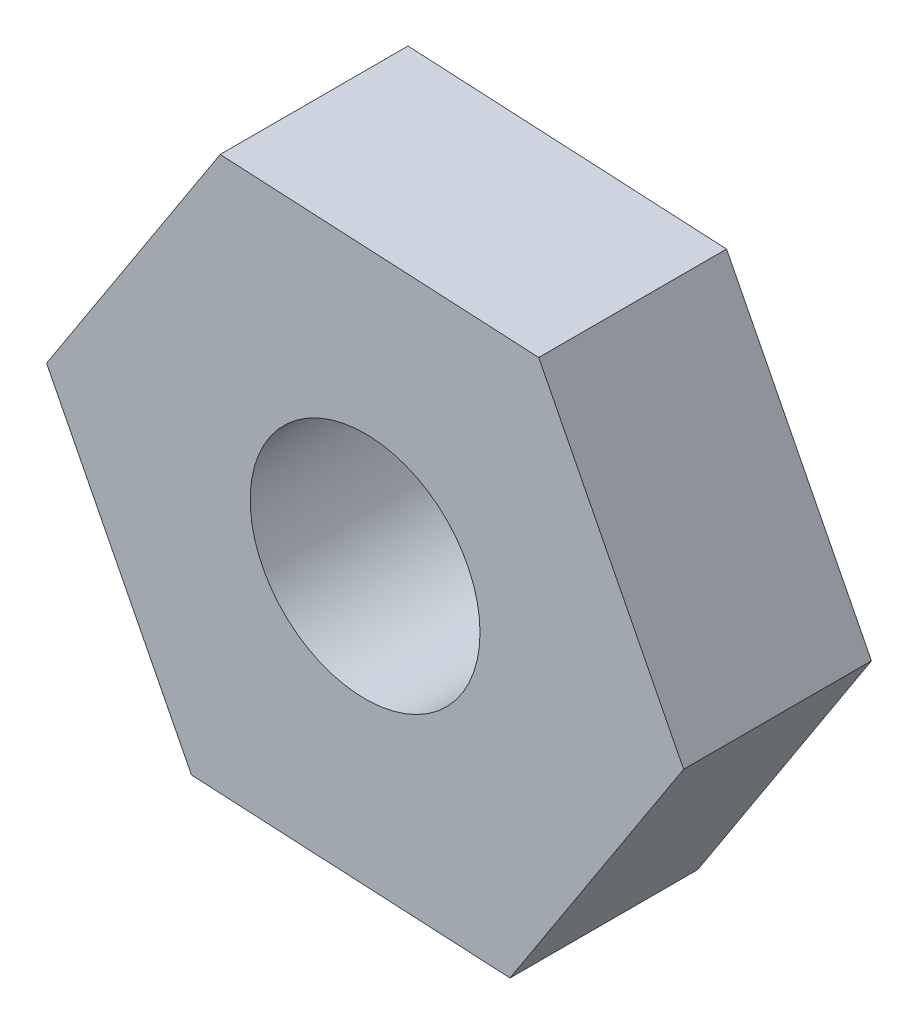
ISO-10303-21;
HEADER;
FILE_DESCRIPTION(('STEP AP214'),'2;1');
FILE_NAME('part.step','',(''),(''),'','','');
FILE_SCHEMA(('AUTOMOTIVE_DESIGN { 1 0 10303 214 1 1 1 1 }'));
ENDSEC;
DATA;
#1=APPLICATION_CONTEXT('core data for automotive mechanical design processes');
#2=APPLICATION_PROTOCOL_DEFINITION('international standard','automotive_design',2000,#1);
#3=PRODUCT_CONTEXT('',#1,'mechanical');
#4=PRODUCT('Part','Part','',(#3));
#5=PRODUCT_RELATED_PRODUCT_CATEGORY('part','',(#4));
#6=PRODUCT_DEFINITION_FORMATION('','',#4);
#7=PRODUCT_DEFINITION_CONTEXT('part definition',#1,'design');
#8=PRODUCT_DEFINITION('design','',#6,#7);
#9=PRODUCT_DEFINITION_SHAPE('','',#8);
#10=(LENGTH_UNIT() NAMED_UNIT(*) SI_UNIT(.MILLI.,.METRE.));
#11=(NAMED_UNIT(*) PLANE_ANGLE_UNIT() SI_UNIT($,.RADIAN.));
#12=(NAMED_UNIT(*) SI_UNIT($,.STERADIAN.) SOLID_ANGLE_UNIT());
#13=UNCERTAINTY_MEASURE_WITH_UNIT(LENGTH_MEASURE(1.E-05),#10,'distance_accuracy_value','');
#14=(GEOMETRIC_REPRESENTATION_CONTEXT(3) GLOBAL_UNCERTAINTY_ASSIGNED_CONTEXT((#13)) GLOBAL_UNIT_ASSIGNED_CONTEXT((#10,
#11,#12)) REPRESENTATION_CONTEXT('',''));
#15=CARTESIAN_POINT('',(0.,0.,0.));
#16=DIRECTION('',(0.,0.,1.));
#17=DIRECTION('',(1.,0.,0.));
#18=AXIS2_PLACEMENT_3D('',#15,#16,#17);
#19=CARTESIAN_POINT('',(0.,0.,7.));
#20=DIRECTION('',(0.,0.,1.));
#21=DIRECTION('',(1.,0.,0.));
#22=AXIS2_PLACEMENT_3D('',#19,#20,#21);
#23=PLANE('',#22);
#24=DIRECTION('',(0.998647533945761,-0.0519913737465246,0.));
#25=VECTOR('',#24,1.);
#26=CARTESIAN_POINT('',(-6.47165974450722,-9.97301415999718,7.));
#27=LINE('',#26,#25);
#28=CARTESIAN_POINT('',(-6.47165974450722,-9.97301415999718,7.));
#29=VERTEX_POINT('',#28);
#30=CARTESIAN_POINT('',(5.40105374260587,-10.591128823391,7.));
#31=VERTEX_POINT('',#30);
#32=EDGE_CURVE('E146',#29,#31,#27,.T.);
#33=ORIENTED_EDGE('',*,*,#32,.T.);
#34=DIRECTION('',(0.544349617415022,0.838858446950449,0.));
#35=VECTOR('',#34,1.);
#36=CARTESIAN_POINT('',(5.40105374260587,-10.591128823391,7.));
#37=LINE('',#36,#35);
#38=CARTESIAN_POINT('',(11.8727134871131,-0.618114663393764,7.));
#39=VERTEX_POINT('',#38);
#40=EDGE_CURVE('E94',#31,#39,#37,.T.);
#41=ORIENTED_EDGE('',*,*,#40,.T.);
#42=DIRECTION('',(-0.454297916530739,0.890849820696974,0.));
#43=VECTOR('',#42,1.);
#44=CARTESIAN_POINT('',(11.8727134871131,-0.618114663393764,7.));
#45=LINE('',#44,#43);
#46=CARTESIAN_POINT('',(6.47165974450721,9.97301415999718,7.));
#47=VERTEX_POINT('',#46);
#48=EDGE_CURVE('E107',#39,#47,#45,.T.);
#49=ORIENTED_EDGE('',*,*,#48,.T.);
#50=DIRECTION('',(-0.998647533945761,0.0519913737465245,0.));
#51=VECTOR('',#50,1.);
#52=CARTESIAN_POINT('',(6.47165974450721,9.97301415999718,7.));
#53=LINE('',#52,#51);
#54=CARTESIAN_POINT('',(-5.40105374260588,10.591128823391,7.));
#55=VERTEX_POINT('',#54);
#56=EDGE_CURVE('E101',#47,#55,#53,.T.);
#57=ORIENTED_EDGE('',*,*,#56,.T.);
#58=DIRECTION('',(-0.544349617415022,-0.838858446950449,0.));
#59=VECTOR('',#58,1.);
#60=CARTESIAN_POINT('',(-5.40105374260588,10.591128823391,7.));
#61=LINE('',#60,#59);
#62=CARTESIAN_POINT('',(-11.8727134871131,0.618114663393768,7.));
#63=VERTEX_POINT('',#62);
#64=EDGE_CURVE('E105',#55,#63,#61,.T.);
#65=ORIENTED_EDGE('',*,*,#64,.T.);
#66=DIRECTION('',(0.454297916530739,-0.890849820696974,0.));
#67=VECTOR('',#66,1.);
#68=CARTESIAN_POINT('',(-11.8727134871131,0.618114663393768,7.));
#69=LINE('',#68,#67);
#70=EDGE_CURVE('E57',#63,#29,#69,.T.);
#71=ORIENTED_EDGE('',*,*,#70,.T.);
#72=EDGE_LOOP('',(#33,#41,#49,#57,#65,#71));
#73=FACE_BOUND('',#72,.T.);
#74=CARTESIAN_POINT('',(0.,0.,7.));
#75=DIRECTION('',(0.,0.,1.));
#76=DIRECTION('',(1.,0.,0.));
#77=AXIS2_PLACEMENT_3D('',#74,#75,#76);
#78=CIRCLE('',#77,4.28343841388034);
#79=CARTESIAN_POINT('',(4.28343841388034,0.,7.));
#80=VERTEX_POINT('',#79);
#81=EDGE_CURVE('E134',#80,#80,#78,.T.);
#82=ORIENTED_EDGE('',*,*,#81,.F.);
#83=EDGE_LOOP('',(#82));
#84=FACE_BOUND('',#83,.T.);
#85=ADVANCED_FACE('F39',(#73,#84),#23,.T.);
#86=CARTESIAN_POINT('',(0.,0.,0.));
#87=DIRECTION('',(0.,0.,1.));
#88=DIRECTION('',(1.,0.,0.));
#89=AXIS2_PLACEMENT_3D('',#86,#87,#88);
#90=PLANE('',#89);
#91=DIRECTION('',(0.998647533945761,-0.0519913737465246,0.));
#92=VECTOR('',#91,1.);
#93=CARTESIAN_POINT('',(-6.47165974450722,-9.97301415999718,0.));
#94=LINE('',#93,#92);
#95=CARTESIAN_POINT('',(-6.47165974450722,-9.97301415999718,0.));
#96=VERTEX_POINT('',#95);
#97=CARTESIAN_POINT('',(5.40105374260587,-10.591128823391,0.));
#98=VERTEX_POINT('',#97);
#99=EDGE_CURVE('E129',#96,#98,#94,.T.);
#100=ORIENTED_EDGE('',*,*,#99,.F.);
#101=DIRECTION('',(0.454297916530739,-0.890849820696974,0.));
#102=VECTOR('',#101,1.);
#103=CARTESIAN_POINT('',(-11.8727134871131,0.618114663393768,0.));
#104=LINE('',#103,#102);
#105=CARTESIAN_POINT('',(-11.8727134871131,0.618114663393768,0.));
#106=VERTEX_POINT('',#105);
#107=EDGE_CURVE('E86',#106,#96,#104,.T.);
#108=ORIENTED_EDGE('',*,*,#107,.F.);
#109=DIRECTION('',(-0.544349617415022,-0.838858446950449,0.));
#110=VECTOR('',#109,1.);
#111=CARTESIAN_POINT('',(-5.40105374260588,10.591128823391,0.));
#112=LINE('',#111,#110);
#113=CARTESIAN_POINT('',(-5.40105374260588,10.591128823391,0.));
#114=VERTEX_POINT('',#113);
#115=EDGE_CURVE('E80',#114,#106,#112,.T.);
#116=ORIENTED_EDGE('',*,*,#115,.F.);
#117=DIRECTION('',(-0.998647533945761,0.0519913737465245,0.));
#118=VECTOR('',#117,1.);
#119=CARTESIAN_POINT('',(6.47165974450721,9.97301415999718,0.));
#120=LINE('',#119,#118);
#121=CARTESIAN_POINT('',(6.47165974450721,9.97301415999718,0.));
#122=VERTEX_POINT('',#121);
#123=EDGE_CURVE('E116',#122,#114,#120,.T.);
#124=ORIENTED_EDGE('',*,*,#123,.F.);
#125=DIRECTION('',(-0.454297916530739,0.890849820696974,0.));
#126=VECTOR('',#125,1.);
#127=CARTESIAN_POINT('',(11.8727134871131,-0.618114663393764,0.));
#128=LINE('',#127,#126);
#129=CARTESIAN_POINT('',(11.8727134871131,-0.618114663393764,0.));
#130=VERTEX_POINT('',#129);
#131=EDGE_CURVE('E137',#130,#122,#128,.T.);
#132=ORIENTED_EDGE('',*,*,#131,.F.);
#133=DIRECTION('',(0.544349617415022,0.838858446950449,0.));
#134=VECTOR('',#133,1.);
#135=CARTESIAN_POINT('',(5.40105374260587,-10.591128823391,0.));
#136=LINE('',#135,#134);
#137=EDGE_CURVE('E133',#98,#130,#136,.T.);
#138=ORIENTED_EDGE('',*,*,#137,.F.);
#139=EDGE_LOOP('',(#100,#108,#116,#124,#132,#138));
#140=FACE_BOUND('',#139,.T.);
#141=CARTESIAN_POINT('',(0.,0.,0.));
#142=DIRECTION('',(0.,0.,1.));
#143=DIRECTION('',(1.,0.,0.));
#144=AXIS2_PLACEMENT_3D('',#141,#142,#143);
#145=CIRCLE('',#144,4.28343841388034);
#146=CARTESIAN_POINT('',(4.28343841388034,0.,0.));
#147=VERTEX_POINT('',#146);
#148=EDGE_CURVE('E243',#147,#147,#145,.T.);
#149=ORIENTED_EDGE('',*,*,#148,.T.);
#150=EDGE_LOOP('',(#149));
#151=FACE_BOUND('',#150,.T.);
#152=ADVANCED_FACE('F159',(#140,#151),#90,.F.);
#153=CARTESIAN_POINT('',(-6.47165974450722,-9.97301415999718,7.));
#154=DIRECTION('',(0.0519913737465247,0.998647533945761,0.));
#155=DIRECTION('',(-0.998647533945761,0.0519913737465247,0.));
#156=AXIS2_PLACEMENT_3D('',#153,#154,#155);
#157=PLANE('',#156);
#158=ORIENTED_EDGE('',*,*,#99,.T.);
#159=DIRECTION('',(0.,0.,-1.));
#160=VECTOR('',#159,1.);
#161=CARTESIAN_POINT('',(5.40105374260587,-10.591128823391,7.));
#162=LINE('',#161,#160);
#163=EDGE_CURVE('E11',#31,#98,#162,.T.);
#164=ORIENTED_EDGE('',*,*,#163,.F.);
#165=ORIENTED_EDGE('',*,*,#32,.F.);
#166=DIRECTION('',(0.,0.,-1.));
#167=VECTOR('',#166,1.);
#168=CARTESIAN_POINT('',(-6.47165974450722,-9.97301415999718,7.));
#169=LINE('',#168,#167);
#170=EDGE_CURVE('E125',#29,#96,#169,.T.);
#171=ORIENTED_EDGE('',*,*,#170,.T.);
#172=EDGE_LOOP('',(#158,#164,#165,#171));
#173=FACE_BOUND('',#172,.T.);
#174=ADVANCED_FACE('F41',(#173),#157,.F.);
#175=CARTESIAN_POINT('',(5.40105374260587,-10.591128823391,7.));
#176=DIRECTION('',(-0.838858446950449,0.544349617415022,0.));
#177=DIRECTION('',(-0.544349617415022,-0.838858446950449,0.));
#178=AXIS2_PLACEMENT_3D('',#175,#176,#177);
#179=PLANE('',#178);
#180=ORIENTED_EDGE('',*,*,#137,.T.);
#181=DIRECTION('',(0.,0.,-1.));
#182=VECTOR('',#181,1.);
#183=CARTESIAN_POINT('',(11.8727134871131,-0.618114663393764,7.));
#184=LINE('',#183,#182);
#185=EDGE_CURVE('E49',#39,#130,#184,.T.);
#186=ORIENTED_EDGE('',*,*,#185,.F.);
#187=ORIENTED_EDGE('',*,*,#40,.F.);
#188=ORIENTED_EDGE('',*,*,#163,.T.);
#189=EDGE_LOOP('',(#180,#186,#187,#188));
#190=FACE_BOUND('',#189,.T.);
#191=ADVANCED_FACE('F184',(#190),#179,.F.);
#192=CARTESIAN_POINT('',(11.8727134871131,-0.618114663393764,7.));
#193=DIRECTION('',(-0.890849820696973,-0.454297916530739,0.));
#194=DIRECTION('',(0.454297916530739,-0.890849820696974,0.));
#195=AXIS2_PLACEMENT_3D('',#192,#193,#194);
#196=PLANE('',#195);
#197=ORIENTED_EDGE('',*,*,#131,.T.);
#198=DIRECTION('',(0.,0.,-1.));
#199=VECTOR('',#198,1.);
#200=CARTESIAN_POINT('',(6.47165974450721,9.97301415999718,7.));
#201=LINE('',#200,#199);
#202=EDGE_CURVE('E118',#47,#122,#201,.T.);
#203=ORIENTED_EDGE('',*,*,#202,.F.);
#204=ORIENTED_EDGE('',*,*,#48,.F.);
#205=ORIENTED_EDGE('',*,*,#185,.T.);
#206=EDGE_LOOP('',(#197,#203,#204,#205));
#207=FACE_BOUND('',#206,.T.);
#208=ADVANCED_FACE('F156',(#207),#196,.F.);
#209=CARTESIAN_POINT('',(6.47165974450721,9.97301415999718,7.));
#210=DIRECTION('',(-0.0519913737465245,-0.998647533945761,0.));
#211=DIRECTION('',(0.998647533945761,-0.0519913737465245,0.));
#212=AXIS2_PLACEMENT_3D('',#209,#210,#211);
#213=PLANE('',#212);
#214=ORIENTED_EDGE('',*,*,#123,.T.);
#215=DIRECTION('',(0.,0.,-1.));
#216=VECTOR('',#215,1.);
#217=CARTESIAN_POINT('',(-5.40105374260588,10.591128823391,7.));
#218=LINE('',#217,#216);
#219=EDGE_CURVE('E113',#55,#114,#218,.T.);
#220=ORIENTED_EDGE('',*,*,#219,.F.);
#221=ORIENTED_EDGE('',*,*,#56,.F.);
#222=ORIENTED_EDGE('',*,*,#202,.T.);
#223=EDGE_LOOP('',(#214,#220,#221,#222));
#224=FACE_BOUND('',#223,.T.);
#225=ADVANCED_FACE('F114',(#224),#213,.F.);
#226=CARTESIAN_POINT('',(-5.40105374260588,10.591128823391,7.));
#227=DIRECTION('',(0.838858446950449,-0.544349617415022,0.));
#228=DIRECTION('',(0.544349617415022,0.838858446950449,0.));
#229=AXIS2_PLACEMENT_3D('',#226,#227,#228);
#230=PLANE('',#229);
#231=ORIENTED_EDGE('',*,*,#115,.T.);
#232=DIRECTION('',(0.,0.,-1.));
#233=VECTOR('',#232,1.);
#234=CARTESIAN_POINT('',(-11.8727134871131,0.618114663393768,7.));
#235=LINE('',#234,#233);
#236=EDGE_CURVE('E119',#63,#106,#235,.T.);
#237=ORIENTED_EDGE('',*,*,#236,.F.);
#238=ORIENTED_EDGE('',*,*,#64,.F.);
#239=ORIENTED_EDGE('',*,*,#219,.T.);
#240=EDGE_LOOP('',(#231,#237,#238,#239));
#241=FACE_BOUND('',#240,.T.);
#242=ADVANCED_FACE('F121',(#241),#230,.F.);
#243=CARTESIAN_POINT('',(-11.8727134871131,0.618114663393768,7.));
#244=DIRECTION('',(0.890849820696973,0.454297916530739,0.));
#245=DIRECTION('',(-0.454297916530739,0.890849820696974,0.));
#246=AXIS2_PLACEMENT_3D('',#243,#244,#245);
#247=PLANE('',#246);
#248=ORIENTED_EDGE('',*,*,#107,.T.);
#249=ORIENTED_EDGE('',*,*,#170,.F.);
#250=ORIENTED_EDGE('',*,*,#70,.F.);
#251=ORIENTED_EDGE('',*,*,#236,.T.);
#252=EDGE_LOOP('',(#248,#249,#250,#251));
#253=FACE_BOUND('',#252,.T.);
#254=ADVANCED_FACE('F164',(#253),#247,.F.);
#255=CARTESIAN_POINT('',(0.,0.,7.));
#256=DIRECTION('',(0.,0.,-1.));
#257=DIRECTION('',(-1.,0.,0.));
#258=AXIS2_PLACEMENT_3D('',#255,#256,#257);
#259=CYLINDRICAL_SURFACE('',#258,4.28343841388034);
#260=ORIENTED_EDGE('',*,*,#81,.T.);
#261=EDGE_LOOP('',(#260));
#262=FACE_BOUND('',#261,.T.);
#263=ORIENTED_EDGE('',*,*,#148,.F.);
#264=EDGE_LOOP('',(#263));
#265=FACE_BOUND('',#264,.T.);
#266=ADVANCED_FACE('F166',(#262,#265),#259,.F.);
#267=CLOSED_SHELL('',(#85,#152,#174,#191,#208,#225,#242,#254,#266));
#268=MANIFOLD_SOLID_BREP('B2',#267);
#269=ADVANCED_BREP_SHAPE_REPRESENTATION('',(#18,#268),#14);
#270=SHAPE_DEFINITION_REPRESENTATION(#9,#269);
ENDSEC;
END-ISO-10303-21;
